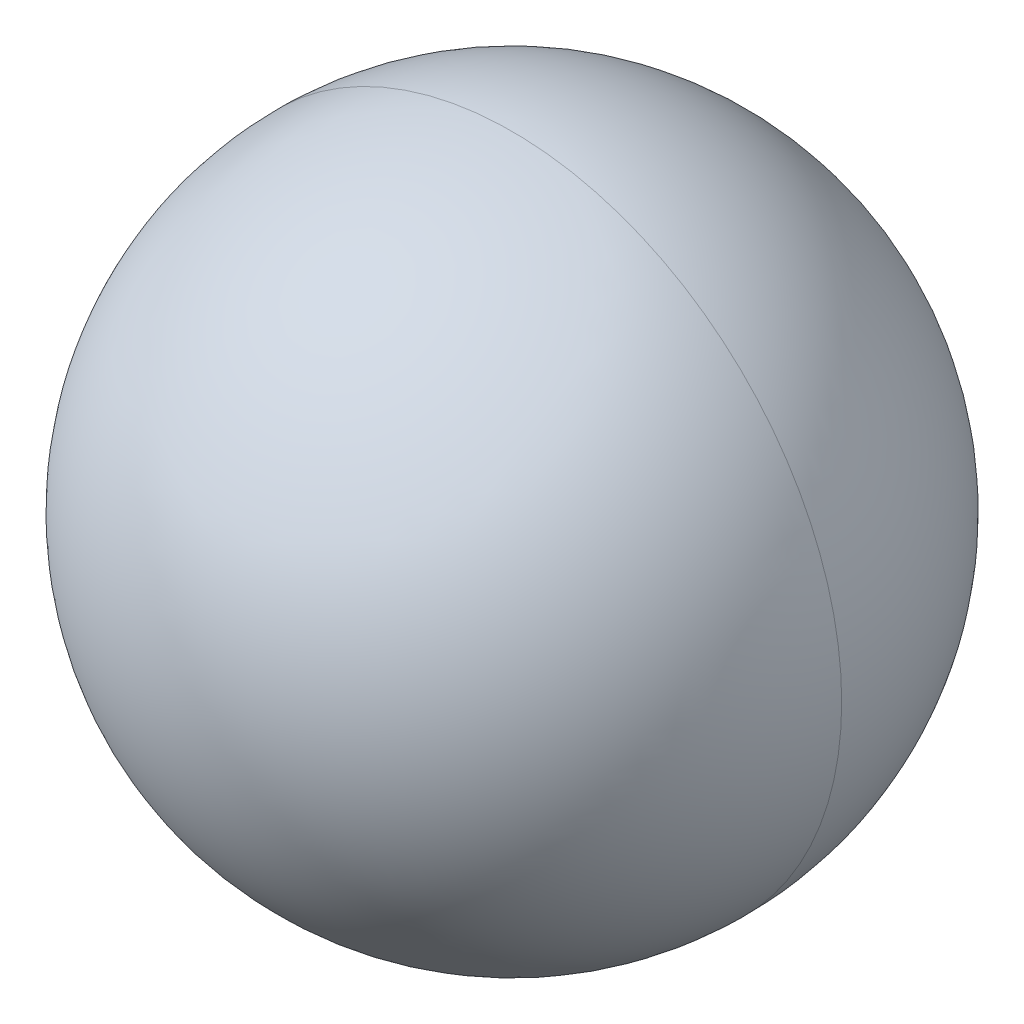
ISO-10303-21;
HEADER;
FILE_DESCRIPTION(('STEP AP214'),'2;1');
FILE_NAME('part.step','',(''),(''),'','','');
FILE_SCHEMA(('AUTOMOTIVE_DESIGN { 1 0 10303 214 1 1 1 1 }'));
ENDSEC;
DATA;
#1=APPLICATION_CONTEXT('core data for automotive mechanical design processes');
#2=APPLICATION_PROTOCOL_DEFINITION('international standard','automotive_design',2000,#1);
#3=PRODUCT_CONTEXT('',#1,'mechanical');
#4=PRODUCT('Part','Part','',(#3));
#5=PRODUCT_RELATED_PRODUCT_CATEGORY('part','',(#4));
#6=PRODUCT_DEFINITION_FORMATION('','',#4);
#7=PRODUCT_DEFINITION_CONTEXT('part definition',#1,'design');
#8=PRODUCT_DEFINITION('design','',#6,#7);
#9=PRODUCT_DEFINITION_SHAPE('','',#8);
#10=(LENGTH_UNIT() NAMED_UNIT(*) SI_UNIT(.MILLI.,.METRE.));
#11=(NAMED_UNIT(*) PLANE_ANGLE_UNIT() SI_UNIT($,.RADIAN.));
#12=(NAMED_UNIT(*) SI_UNIT($,.STERADIAN.) SOLID_ANGLE_UNIT());
#13=UNCERTAINTY_MEASURE_WITH_UNIT(LENGTH_MEASURE(1.E-05),#10,'distance_accuracy_value','');
#14=(GEOMETRIC_REPRESENTATION_CONTEXT(3) GLOBAL_UNCERTAINTY_ASSIGNED_CONTEXT((#13)) GLOBAL_UNIT_ASSIGNED_CONTEXT((#10,
#11,#12)) REPRESENTATION_CONTEXT('',''));
#15=CARTESIAN_POINT('',(0.,0.,0.));
#16=DIRECTION('',(0.,0.,1.));
#17=DIRECTION('',(1.,0.,0.));
#18=AXIS2_PLACEMENT_3D('',#15,#16,#17);
#19=CARTESIAN_POINT('',(10.5,12.5955,0.));
#20=DIRECTION('',(1.,0.,0.));
#21=DIRECTION('',(0.,0.,-1.));
#22=AXIS2_PLACEMENT_3D('',#19,#20,#21);
#23=SPHERICAL_SURFACE('',#22,3.);
#24=CARTESIAN_POINT('',(10.5,12.5955,0.));
#25=DIRECTION('',(0.,0.,1.));
#26=DIRECTION('',(1.,0.,0.));
#27=AXIS2_PLACEMENT_3D('',#24,#25,#26);
#28=CIRCLE('',#27,3.);
#29=CARTESIAN_POINT('',(13.5,12.5955,0.));
#30=VERTEX_POINT('',#29);
#31=CARTESIAN_POINT('',(7.5,12.5955,0.));
#32=VERTEX_POINT('',#31);
#33=EDGE_CURVE('E11',#30,#32,#28,.T.);
#34=ORIENTED_EDGE('',*,*,#33,.T.);
#35=CARTESIAN_POINT('',(10.5,12.5955,0.));
#36=DIRECTION('',(0.,0.,-1.));
#37=DIRECTION('',(1.,0.,0.));
#38=AXIS2_PLACEMENT_3D('',#35,#36,#37);
#39=CIRCLE('',#38,3.);
#40=EDGE_CURVE('E25',#30,#32,#39,.T.);
#41=ORIENTED_EDGE('',*,*,#40,.F.);
#42=EDGE_LOOP('',(#34,#41));
#43=FACE_BOUND('',#42,.T.);
#44=ADVANCED_FACE('F17',(#43),#23,.T.);
#45=CARTESIAN_POINT('',(10.5,12.5955,0.));
#46=DIRECTION('',(1.,0.,0.));
#47=DIRECTION('',(0.,0.,1.));
#48=AXIS2_PLACEMENT_3D('',#45,#46,#47);
#49=SPHERICAL_SURFACE('',#48,3.);
#50=ORIENTED_EDGE('',*,*,#33,.F.);
#51=ORIENTED_EDGE('',*,*,#40,.T.);
#52=EDGE_LOOP('',(#50,#51));
#53=FACE_BOUND('',#52,.T.);
#54=ADVANCED_FACE('F33',(#53),#49,.T.);
#55=CLOSED_SHELL('',(#44,#54));
#56=MANIFOLD_SOLID_BREP('B1',#55);
#57=ADVANCED_BREP_SHAPE_REPRESENTATION('',(#18,#56),#14);
#58=SHAPE_DEFINITION_REPRESENTATION(#9,#57);
ENDSEC;
END-ISO-10303-21;
